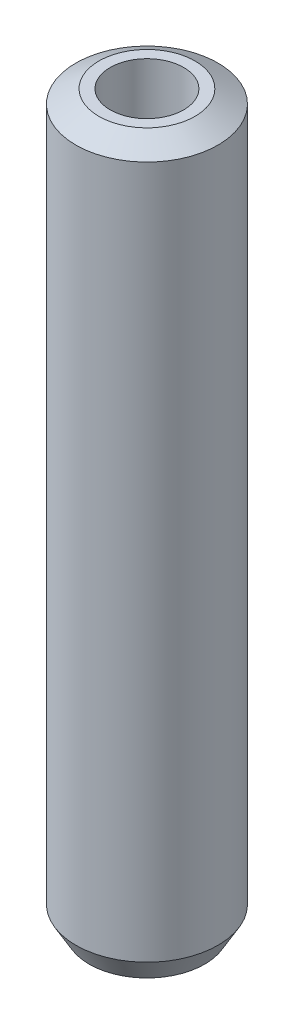
ISO-10303-21;
HEADER;
FILE_DESCRIPTION(('STEP AP214'),'2;1');
FILE_NAME('part.step','',(''),(''),'','','');
FILE_SCHEMA(('AUTOMOTIVE_DESIGN { 1 0 10303 214 1 1 1 1 }'));
ENDSEC;
DATA;
#1=APPLICATION_CONTEXT('core data for automotive mechanical design processes');
#2=APPLICATION_PROTOCOL_DEFINITION('international standard','automotive_design',2000,#1);
#3=PRODUCT_CONTEXT('',#1,'mechanical');
#4=PRODUCT('Part','Part','',(#3));
#5=PRODUCT_RELATED_PRODUCT_CATEGORY('part','',(#4));
#6=PRODUCT_DEFINITION_FORMATION('','',#4);
#7=PRODUCT_DEFINITION_CONTEXT('part definition',#1,'design');
#8=PRODUCT_DEFINITION('design','',#6,#7);
#9=PRODUCT_DEFINITION_SHAPE('','',#8);
#10=(LENGTH_UNIT() NAMED_UNIT(*) SI_UNIT(.MILLI.,.METRE.));
#11=(NAMED_UNIT(*) PLANE_ANGLE_UNIT() SI_UNIT($,.RADIAN.));
#12=(NAMED_UNIT(*) SI_UNIT($,.STERADIAN.) SOLID_ANGLE_UNIT());
#13=UNCERTAINTY_MEASURE_WITH_UNIT(LENGTH_MEASURE(1.E-05),#10,'distance_accuracy_value','');
#14=(GEOMETRIC_REPRESENTATION_CONTEXT(3) GLOBAL_UNCERTAINTY_ASSIGNED_CONTEXT((#13)) GLOBAL_UNIT_ASSIGNED_CONTEXT((#10,
#11,#12)) REPRESENTATION_CONTEXT('',''));
#15=CARTESIAN_POINT('',(0.,0.,0.));
#16=DIRECTION('',(0.,0.,1.));
#17=DIRECTION('',(1.,0.,0.));
#18=AXIS2_PLACEMENT_3D('',#15,#16,#17);
#19=CARTESIAN_POINT('',(0.,230.808300723901,0.));
#20=DIRECTION('',(0.,-1.,0.));
#21=DIRECTION('',(0.,0.,-1.));
#22=AXIS2_PLACEMENT_3D('',#19,#20,#21);
#23=CYLINDRICAL_SURFACE('',#22,22.5);
#24=CARTESIAN_POINT('',(0.,226.592121115096,0.));
#25=DIRECTION('',(0.,1.,0.));
#26=DIRECTION('',(0.,0.,1.));
#27=AXIS2_PLACEMENT_3D('',#24,#25,#26);
#28=CIRCLE('',#27,22.5);
#29=CARTESIAN_POINT('',(0.,226.592121115096,22.5));
#30=VERTEX_POINT('',#29);
#31=EDGE_CURVE('E50',#30,#30,#28,.F.);
#32=ORIENTED_EDGE('',*,*,#31,.T.);
#33=EDGE_LOOP('',(#32));
#34=FACE_BOUND('',#33,.T.);
#35=CARTESIAN_POINT('',(0.,7.30263729628555,0.));
#36=DIRECTION('',(0.,1.,0.));
#37=DIRECTION('',(0.,0.,1.));
#38=AXIS2_PLACEMENT_3D('',#35,#36,#37);
#39=CIRCLE('',#38,22.5);
#40=CARTESIAN_POINT('',(0.,7.30263729628555,22.5));
#41=VERTEX_POINT('',#40);
#42=EDGE_CURVE('E51',#41,#41,#39,.T.);
#43=ORIENTED_EDGE('',*,*,#42,.T.);
#44=EDGE_LOOP('',(#43));
#45=FACE_BOUND('',#44,.T.);
#46=ADVANCED_FACE('F39',(#34,#45),#23,.T.);
#47=CARTESIAN_POINT('',(0.,230.808300723901,0.));
#48=DIRECTION('',(0.,1.,0.));
#49=DIRECTION('',(0.,0.,1.));
#50=AXIS2_PLACEMENT_3D('',#47,#48,#49);
#51=PLANE('',#50);
#52=CARTESIAN_POINT('',(0.,230.808300723901,0.));
#53=DIRECTION('',(0.,1.,0.));
#54=DIRECTION('',(0.,0.,1.));
#55=AXIS2_PLACEMENT_3D('',#52,#53,#54);
#56=CIRCLE('',#55,15.1973627037146);
#57=CARTESIAN_POINT('',(0.,230.808300723901,15.1973627037146));
#58=VERTEX_POINT('',#57);
#59=EDGE_CURVE('E54',#58,#58,#56,.T.);
#60=ORIENTED_EDGE('',*,*,#59,.T.);
#61=EDGE_LOOP('',(#60));
#62=FACE_BOUND('',#61,.T.);
#63=CARTESIAN_POINT('',(0.,230.808300723901,0.));
#64=DIRECTION('',(0.,1.,0.));
#65=DIRECTION('',(0.,0.,1.));
#66=AXIS2_PLACEMENT_3D('',#63,#64,#65);
#67=CIRCLE('',#66,11.6330761835104);
#68=CARTESIAN_POINT('',(0.,230.808300723901,11.6330761835104));
#69=VERTEX_POINT('',#68);
#70=EDGE_CURVE('E58',#69,#69,#67,.T.);
#71=ORIENTED_EDGE('',*,*,#70,.F.);
#72=EDGE_LOOP('',(#71));
#73=FACE_BOUND('',#72,.T.);
#74=ADVANCED_FACE('F69',(#62,#73),#51,.T.);
#75=CARTESIAN_POINT('',(0.,0.,0.));
#76=DIRECTION('',(0.,1.,0.));
#77=DIRECTION('',(0.,0.,1.));
#78=AXIS2_PLACEMENT_3D('',#75,#76,#77);
#79=PLANE('',#78);
#80=CARTESIAN_POINT('',(0.,0.,0.));
#81=DIRECTION('',(0.,1.,0.));
#82=DIRECTION('',(0.,0.,1.));
#83=AXIS2_PLACEMENT_3D('',#80,#81,#82);
#84=CIRCLE('',#83,18.2838203911953);
#85=CARTESIAN_POINT('',(0.,0.,18.2838203911953));
#86=VERTEX_POINT('',#85);
#87=EDGE_CURVE('E10',#86,#86,#84,.F.);
#88=ORIENTED_EDGE('',*,*,#87,.T.);
#89=EDGE_LOOP('',(#88));
#90=FACE_BOUND('',#89,.T.);
#91=CARTESIAN_POINT('',(0.,0.,0.));
#92=DIRECTION('',(0.,1.,0.));
#93=DIRECTION('',(0.,0.,1.));
#94=AXIS2_PLACEMENT_3D('',#91,#92,#93);
#95=CIRCLE('',#94,11.6330761835104);
#96=CARTESIAN_POINT('',(0.,0.,11.6330761835104));
#97=VERTEX_POINT('',#96);
#98=EDGE_CURVE('E63',#97,#97,#95,.T.);
#99=ORIENTED_EDGE('',*,*,#98,.T.);
#100=EDGE_LOOP('',(#99));
#101=FACE_BOUND('',#100,.T.);
#102=ADVANCED_FACE('F75',(#90,#101),#79,.F.);
#103=CARTESIAN_POINT('',(0.,230.808300723901,0.));
#104=DIRECTION('',(0.,-1.,0.));
#105=DIRECTION('',(0.,0.,-1.));
#106=AXIS2_PLACEMENT_3D('',#103,#104,#105);
#107=CYLINDRICAL_SURFACE('',#106,11.6330761835104);
#108=ORIENTED_EDGE('',*,*,#70,.T.);
#109=EDGE_LOOP('',(#108));
#110=FACE_BOUND('',#109,.T.);
#111=ORIENTED_EDGE('',*,*,#98,.F.);
#112=EDGE_LOOP('',(#111));
#113=FACE_BOUND('',#112,.T.);
#114=ADVANCED_FACE('F70',(#110,#113),#107,.F.);
#115=CARTESIAN_POINT('',(0.,230.808300723901,0.));
#116=DIRECTION('',(0.,-1.,0.));
#117=DIRECTION('',(0.,0.,-1.));
#118=AXIS2_PLACEMENT_3D('',#115,#116,#117);
#119=CONICAL_SURFACE('',#118,15.1973627037146,1.04719755119659);
#120=ORIENTED_EDGE('',*,*,#31,.F.);
#121=EDGE_LOOP('',(#120));
#122=FACE_BOUND('',#121,.T.);
#123=ORIENTED_EDGE('',*,*,#59,.F.);
#124=EDGE_LOOP('',(#123));
#125=FACE_BOUND('',#124,.T.);
#126=ADVANCED_FACE('F81',(#122,#125),#119,.T.);
#127=CARTESIAN_POINT('',(0.,7.30263729628555,0.));
#128=DIRECTION('',(0.,1.,0.));
#129=DIRECTION('',(0.,0.,1.));
#130=AXIS2_PLACEMENT_3D('',#127,#128,#129);
#131=CONICAL_SURFACE('',#130,22.5,0.523598775598302);
#132=ORIENTED_EDGE('',*,*,#87,.F.);
#133=EDGE_LOOP('',(#132));
#134=FACE_BOUND('',#133,.T.);
#135=ORIENTED_EDGE('',*,*,#42,.F.);
#136=EDGE_LOOP('',(#135));
#137=FACE_BOUND('',#136,.T.);
#138=ADVANCED_FACE('F45',(#134,#137),#131,.T.);
#139=CLOSED_SHELL('',(#46,#74,#102,#114,#126,#138));
#140=MANIFOLD_SOLID_BREP('B2',#139);
#141=ADVANCED_BREP_SHAPE_REPRESENTATION('',(#18,#140),#14);
#142=SHAPE_DEFINITION_REPRESENTATION(#9,#141);
ENDSEC;
END-ISO-10303-21;
